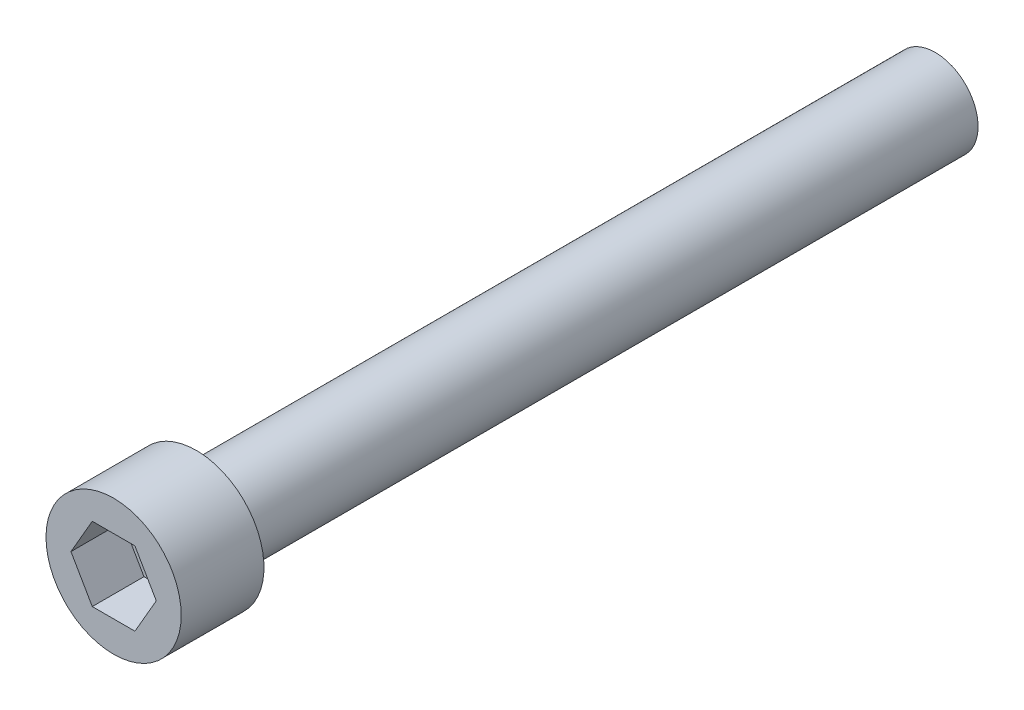
ISO-10303-21;
HEADER;
FILE_DESCRIPTION(('STEP AP214'),'2;1');
FILE_NAME('part.step','',(''),(''),'','','');
FILE_SCHEMA(('AUTOMOTIVE_DESIGN { 1 0 10303 214 1 1 1 1 }'));
ENDSEC;
DATA;
#1=APPLICATION_CONTEXT('core data for automotive mechanical design processes');
#2=APPLICATION_PROTOCOL_DEFINITION('international standard','automotive_design',2000,#1);
#3=PRODUCT_CONTEXT('',#1,'mechanical');
#4=PRODUCT('Part','Part','',(#3));
#5=PRODUCT_RELATED_PRODUCT_CATEGORY('part','',(#4));
#6=PRODUCT_DEFINITION_FORMATION('','',#4);
#7=PRODUCT_DEFINITION_CONTEXT('part definition',#1,'design');
#8=PRODUCT_DEFINITION('design','',#6,#7);
#9=PRODUCT_DEFINITION_SHAPE('','',#8);
#10=(LENGTH_UNIT() NAMED_UNIT(*) SI_UNIT(.MILLI.,.METRE.));
#11=(NAMED_UNIT(*) PLANE_ANGLE_UNIT() SI_UNIT($,.RADIAN.));
#12=(NAMED_UNIT(*) SI_UNIT($,.STERADIAN.) SOLID_ANGLE_UNIT());
#13=UNCERTAINTY_MEASURE_WITH_UNIT(LENGTH_MEASURE(1.E-05),#10,'distance_accuracy_value','');
#14=(GEOMETRIC_REPRESENTATION_CONTEXT(3) GLOBAL_UNCERTAINTY_ASSIGNED_CONTEXT((#13)) GLOBAL_UNIT_ASSIGNED_CONTEXT((#10,
#11,#12)) REPRESENTATION_CONTEXT('',''));
#15=CARTESIAN_POINT('',(0.,0.,0.));
#16=DIRECTION('',(0.,0.,1.));
#17=DIRECTION('',(1.,0.,0.));
#18=AXIS2_PLACEMENT_3D('',#15,#16,#17);
#19=CARTESIAN_POINT('',(0.,0.,28.2448));
#20=DIRECTION('',(0.,0.,-1.));
#21=DIRECTION('',(-1.,0.,0.));
#22=AXIS2_PLACEMENT_3D('',#19,#20,#21);
#23=CYLINDRICAL_SURFACE('',#22,2.3241);
#24=CARTESIAN_POINT('',(0.,0.,28.2448));
#25=DIRECTION('',(0.,0.,1.));
#26=DIRECTION('',(1.,0.,0.));
#27=AXIS2_PLACEMENT_3D('',#24,#25,#26);
#28=CIRCLE('',#27,2.3241);
#29=CARTESIAN_POINT('',(2.3241,0.,28.2448));
#30=VERTEX_POINT('',#29);
#31=EDGE_CURVE('E12',#30,#30,#28,.T.);
#32=ORIENTED_EDGE('',*,*,#31,.F.);
#33=EDGE_LOOP('',(#32));
#34=FACE_BOUND('',#33,.T.);
#35=CARTESIAN_POINT('',(0.,0.,25.4));
#36=DIRECTION('',(0.,0.,-1.));
#37=DIRECTION('',(-1.,0.,0.));
#38=AXIS2_PLACEMENT_3D('',#35,#36,#37);
#39=CIRCLE('',#38,2.3241);
#40=CARTESIAN_POINT('',(-2.3241,0.,25.4));
#41=VERTEX_POINT('',#40);
#42=EDGE_CURVE('E44',#41,#41,#39,.T.);
#43=ORIENTED_EDGE('',*,*,#42,.F.);
#44=EDGE_LOOP('',(#43));
#45=FACE_BOUND('',#44,.T.);
#46=ADVANCED_FACE('F41',(#34,#45),#23,.T.);
#47=CARTESIAN_POINT('',(0.,0.,28.2448));
#48=DIRECTION('',(0.,0.,1.));
#49=DIRECTION('',(1.,0.,0.));
#50=AXIS2_PLACEMENT_3D('',#47,#48,#49);
#51=PLANE('',#50);
#52=DIRECTION('',(0.5,0.866025403784439,0.));
#53=VECTOR('',#52,1.);
#54=CARTESIAN_POINT('',(0.733234841870825,-1.27,28.2448));
#55=LINE('',#54,#53);
#56=CARTESIAN_POINT('',(0.733234841870825,-1.27,28.2448));
#57=VERTEX_POINT('',#56);
#58=CARTESIAN_POINT('',(1.46646968374165,0.,28.2448));
#59=VERTEX_POINT('',#58);
#60=EDGE_CURVE('E59',#57,#59,#55,.T.);
#61=ORIENTED_EDGE('',*,*,#60,.F.);
#62=DIRECTION('',(1.,0.,0.));
#63=VECTOR('',#62,1.);
#64=CARTESIAN_POINT('',(-0.733234841870825,-1.27,28.2448));
#65=LINE('',#64,#63);
#66=CARTESIAN_POINT('',(-0.733234841870825,-1.27,28.2448));
#67=VERTEX_POINT('',#66);
#68=EDGE_CURVE('E162',#67,#57,#65,.T.);
#69=ORIENTED_EDGE('',*,*,#68,.F.);
#70=DIRECTION('',(0.5,-0.866025403784439,0.));
#71=VECTOR('',#70,1.);
#72=CARTESIAN_POINT('',(-1.46646968374165,0.,28.2448));
#73=LINE('',#72,#71);
#74=CARTESIAN_POINT('',(-1.46646968374165,0.,28.2448));
#75=VERTEX_POINT('',#74);
#76=EDGE_CURVE('E159',#75,#67,#73,.T.);
#77=ORIENTED_EDGE('',*,*,#76,.F.);
#78=DIRECTION('',(-0.5,-0.866025403784439,0.));
#79=VECTOR('',#78,1.);
#80=CARTESIAN_POINT('',(-0.733234841870826,1.27,28.2448));
#81=LINE('',#80,#79);
#82=CARTESIAN_POINT('',(-0.733234841870826,1.27,28.2448));
#83=VERTEX_POINT('',#82);
#84=EDGE_CURVE('E116',#83,#75,#81,.T.);
#85=ORIENTED_EDGE('',*,*,#84,.F.);
#86=DIRECTION('',(-1.,0.,0.));
#87=VECTOR('',#86,1.);
#88=CARTESIAN_POINT('',(0.733234841870825,1.27,28.2448));
#89=LINE('',#88,#87);
#90=CARTESIAN_POINT('',(0.733234841870825,1.27,28.2448));
#91=VERTEX_POINT('',#90);
#92=EDGE_CURVE('E153',#91,#83,#89,.T.);
#93=ORIENTED_EDGE('',*,*,#92,.F.);
#94=DIRECTION('',(-0.5,0.866025403784439,0.));
#95=VECTOR('',#94,1.);
#96=CARTESIAN_POINT('',(1.46646968374165,0.,28.2448));
#97=LINE('',#96,#95);
#98=EDGE_CURVE('E149',#59,#91,#97,.T.);
#99=ORIENTED_EDGE('',*,*,#98,.F.);
#100=EDGE_LOOP('',(#61,#69,#77,#85,#93,#99));
#101=FACE_BOUND('',#100,.T.);
#102=ORIENTED_EDGE('',*,*,#31,.T.);
#103=EDGE_LOOP('',(#102));
#104=FACE_BOUND('',#103,.T.);
#105=ADVANCED_FACE('F198',(#101,#104),#51,.T.);
#106=CARTESIAN_POINT('',(0.,0.,25.4));
#107=DIRECTION('',(0.,0.,-1.));
#108=DIRECTION('',(-1.,0.,0.));
#109=AXIS2_PLACEMENT_3D('',#106,#107,#108);
#110=PLANE('',#109);
#111=CARTESIAN_POINT('',(0.,0.,25.4));
#112=DIRECTION('',(0.,0.,-1.));
#113=DIRECTION('',(-1.,0.,0.));
#114=AXIS2_PLACEMENT_3D('',#111,#112,#113);
#115=CIRCLE('',#114,1.4732);
#116=CARTESIAN_POINT('',(-1.4732,0.,25.4));
#117=VERTEX_POINT('',#116);
#118=EDGE_CURVE('E177',#117,#117,#115,.T.);
#119=ORIENTED_EDGE('',*,*,#118,.F.);
#120=EDGE_LOOP('',(#119));
#121=FACE_BOUND('',#120,.T.);
#122=ORIENTED_EDGE('',*,*,#42,.T.);
#123=EDGE_LOOP('',(#122));
#124=FACE_BOUND('',#123,.T.);
#125=ADVANCED_FACE('F190',(#121,#124),#110,.T.);
#126=CARTESIAN_POINT('',(0.,0.,25.4));
#127=DIRECTION('',(0.,0.,-1.));
#128=DIRECTION('',(-1.,0.,0.));
#129=AXIS2_PLACEMENT_3D('',#126,#127,#128);
#130=CYLINDRICAL_SURFACE('',#129,1.4732);
#131=ORIENTED_EDGE('',*,*,#118,.T.);
#132=EDGE_LOOP('',(#131));
#133=FACE_BOUND('',#132,.T.);
#134=CARTESIAN_POINT('',(0.,0.,0.));
#135=DIRECTION('',(0.,0.,-1.));
#136=DIRECTION('',(-1.,0.,0.));
#137=AXIS2_PLACEMENT_3D('',#134,#135,#136);
#138=CIRCLE('',#137,1.4732);
#139=CARTESIAN_POINT('',(-1.4732,0.,0.));
#140=VERTEX_POINT('',#139);
#141=EDGE_CURVE('E167',#140,#140,#138,.T.);
#142=ORIENTED_EDGE('',*,*,#141,.F.);
#143=EDGE_LOOP('',(#142));
#144=FACE_BOUND('',#143,.T.);
#145=ADVANCED_FACE('F188',(#133,#144),#130,.T.);
#146=CARTESIAN_POINT('',(0.,0.,0.));
#147=DIRECTION('',(0.,0.,1.));
#148=DIRECTION('',(1.,0.,0.));
#149=AXIS2_PLACEMENT_3D('',#146,#147,#148);
#150=PLANE('',#149);
#151=ORIENTED_EDGE('',*,*,#141,.T.);
#152=EDGE_LOOP('',(#151));
#153=FACE_BOUND('',#152,.T.);
#154=ADVANCED_FACE('F186',(#153),#150,.F.);
#155=CARTESIAN_POINT('',(0.733234841870825,-1.27,26.4668));
#156=DIRECTION('',(0.866025403784439,-0.5,0.));
#157=DIRECTION('',(0.5,0.866025403784439,0.));
#158=AXIS2_PLACEMENT_3D('',#155,#156,#157);
#159=PLANE('',#158);
#160=ORIENTED_EDGE('',*,*,#60,.T.);
#161=DIRECTION('',(0.,0.,1.));
#162=VECTOR('',#161,1.);
#163=CARTESIAN_POINT('',(1.46646968374165,0.,26.4668));
#164=LINE('',#163,#162);
#165=CARTESIAN_POINT('',(1.46646968374165,0.,26.4668));
#166=VERTEX_POINT('',#165);
#167=EDGE_CURVE('E97',#166,#59,#164,.T.);
#168=ORIENTED_EDGE('',*,*,#167,.F.);
#169=DIRECTION('',(0.5,0.866025403784439,0.));
#170=VECTOR('',#169,1.);
#171=CARTESIAN_POINT('',(0.733234841870825,-1.27,26.4668));
#172=LINE('',#171,#170);
#173=CARTESIAN_POINT('',(0.733234841870825,-1.27,26.4668));
#174=VERTEX_POINT('',#173);
#175=EDGE_CURVE('E165',#174,#166,#172,.T.);
#176=ORIENTED_EDGE('',*,*,#175,.F.);
#177=DIRECTION('',(0.,0.,1.));
#178=VECTOR('',#177,1.);
#179=CARTESIAN_POINT('',(0.733234841870825,-1.27,26.4668));
#180=LINE('',#179,#178);
#181=EDGE_CURVE('E68',#174,#57,#180,.T.);
#182=ORIENTED_EDGE('',*,*,#181,.T.);
#183=EDGE_LOOP('',(#160,#168,#176,#182));
#184=FACE_BOUND('',#183,.T.);
#185=ADVANCED_FACE('F197',(#184),#159,.F.);
#186=CARTESIAN_POINT('',(-0.733234841870825,-1.27,26.4668));
#187=DIRECTION('',(0.,-1.,0.));
#188=DIRECTION('',(0.,0.,-1.));
#189=AXIS2_PLACEMENT_3D('',#186,#187,#188);
#190=PLANE('',#189);
#191=ORIENTED_EDGE('',*,*,#68,.T.);
#192=ORIENTED_EDGE('',*,*,#181,.F.);
#193=DIRECTION('',(1.,0.,0.));
#194=VECTOR('',#193,1.);
#195=CARTESIAN_POINT('',(-0.733234841870825,-1.27,26.4668));
#196=LINE('',#195,#194);
#197=CARTESIAN_POINT('',(-0.733234841870825,-1.27,26.4668));
#198=VERTEX_POINT('',#197);
#199=EDGE_CURVE('E130',#198,#174,#196,.T.);
#200=ORIENTED_EDGE('',*,*,#199,.F.);
#201=DIRECTION('',(0.,0.,1.));
#202=VECTOR('',#201,1.);
#203=CARTESIAN_POINT('',(-0.733234841870825,-1.27,26.4668));
#204=LINE('',#203,#202);
#205=EDGE_CURVE('E121',#198,#67,#204,.T.);
#206=ORIENTED_EDGE('',*,*,#205,.T.);
#207=EDGE_LOOP('',(#191,#192,#200,#206));
#208=FACE_BOUND('',#207,.T.);
#209=ADVANCED_FACE('F226',(#208),#190,.F.);
#210=CARTESIAN_POINT('',(-1.46646968374165,0.,26.4668));
#211=DIRECTION('',(-0.866025403784439,-0.5,0.));
#212=DIRECTION('',(0.5,-0.866025403784439,0.));
#213=AXIS2_PLACEMENT_3D('',#210,#211,#212);
#214=PLANE('',#213);
#215=ORIENTED_EDGE('',*,*,#76,.T.);
#216=ORIENTED_EDGE('',*,*,#205,.F.);
#217=DIRECTION('',(0.5,-0.866025403784439,0.));
#218=VECTOR('',#217,1.);
#219=CARTESIAN_POINT('',(-1.46646968374165,0.,26.4668));
#220=LINE('',#219,#218);
#221=CARTESIAN_POINT('',(-1.46646968374165,0.,26.4668));
#222=VERTEX_POINT('',#221);
#223=EDGE_CURVE('E125',#222,#198,#220,.T.);
#224=ORIENTED_EDGE('',*,*,#223,.F.);
#225=DIRECTION('',(0.,0.,1.));
#226=VECTOR('',#225,1.);
#227=CARTESIAN_POINT('',(-1.46646968374165,0.,26.4668));
#228=LINE('',#227,#226);
#229=EDGE_CURVE('E109',#222,#75,#228,.T.);
#230=ORIENTED_EDGE('',*,*,#229,.T.);
#231=EDGE_LOOP('',(#215,#216,#224,#230));
#232=FACE_BOUND('',#231,.T.);
#233=ADVANCED_FACE('F126',(#232),#214,.F.);
#234=CARTESIAN_POINT('',(-0.733234841870826,1.27,26.4668));
#235=DIRECTION('',(-0.866025403784439,0.5,0.));
#236=DIRECTION('',(-0.5,-0.866025403784439,0.));
#237=AXIS2_PLACEMENT_3D('',#234,#235,#236);
#238=PLANE('',#237);
#239=ORIENTED_EDGE('',*,*,#84,.T.);
#240=ORIENTED_EDGE('',*,*,#229,.F.);
#241=DIRECTION('',(-0.5,-0.866025403784439,0.));
#242=VECTOR('',#241,1.);
#243=CARTESIAN_POINT('',(-0.733234841870826,1.27,26.4668));
#244=LINE('',#243,#242);
#245=CARTESIAN_POINT('',(-0.733234841870826,1.27,26.4668));
#246=VERTEX_POINT('',#245);
#247=EDGE_CURVE('E113',#246,#222,#244,.T.);
#248=ORIENTED_EDGE('',*,*,#247,.F.);
#249=DIRECTION('',(0.,0.,1.));
#250=VECTOR('',#249,1.);
#251=CARTESIAN_POINT('',(-0.733234841870826,1.27,26.4668));
#252=LINE('',#251,#250);
#253=EDGE_CURVE('E122',#246,#83,#252,.T.);
#254=ORIENTED_EDGE('',*,*,#253,.T.);
#255=EDGE_LOOP('',(#239,#240,#248,#254));
#256=FACE_BOUND('',#255,.T.);
#257=ADVANCED_FACE('F111',(#256),#238,.F.);
#258=CARTESIAN_POINT('',(0.733234841870825,1.27,26.4668));
#259=DIRECTION('',(0.,1.,0.));
#260=DIRECTION('',(-1.,0.,0.));
#261=AXIS2_PLACEMENT_3D('',#258,#259,#260);
#262=PLANE('',#261);
#263=ORIENTED_EDGE('',*,*,#92,.T.);
#264=ORIENTED_EDGE('',*,*,#253,.F.);
#265=DIRECTION('',(-1.,0.,0.));
#266=VECTOR('',#265,1.);
#267=CARTESIAN_POINT('',(0.733234841870825,1.27,26.4668));
#268=LINE('',#267,#266);
#269=CARTESIAN_POINT('',(0.733234841870825,1.27,26.4668));
#270=VERTEX_POINT('',#269);
#271=EDGE_CURVE('E136',#270,#246,#268,.T.);
#272=ORIENTED_EDGE('',*,*,#271,.F.);
#273=DIRECTION('',(0.,0.,1.));
#274=VECTOR('',#273,1.);
#275=CARTESIAN_POINT('',(0.733234841870825,1.27,26.4668));
#276=LINE('',#275,#274);
#277=EDGE_CURVE('E172',#270,#91,#276,.T.);
#278=ORIENTED_EDGE('',*,*,#277,.T.);
#279=EDGE_LOOP('',(#263,#264,#272,#278));
#280=FACE_BOUND('',#279,.T.);
#281=ADVANCED_FACE('F234',(#280),#262,.F.);
#282=CARTESIAN_POINT('',(1.46646968374165,0.,26.4668));
#283=DIRECTION('',(0.866025403784439,0.5,0.));
#284=DIRECTION('',(-0.5,0.866025403784439,0.));
#285=AXIS2_PLACEMENT_3D('',#282,#283,#284);
#286=PLANE('',#285);
#287=ORIENTED_EDGE('',*,*,#98,.T.);
#288=ORIENTED_EDGE('',*,*,#277,.F.);
#289=DIRECTION('',(-0.5,0.866025403784439,0.));
#290=VECTOR('',#289,1.);
#291=CARTESIAN_POINT('',(1.46646968374165,0.,26.4668));
#292=LINE('',#291,#290);
#293=EDGE_CURVE('E141',#166,#270,#292,.T.);
#294=ORIENTED_EDGE('',*,*,#293,.F.);
#295=ORIENTED_EDGE('',*,*,#167,.T.);
#296=EDGE_LOOP('',(#287,#288,#294,#295));
#297=FACE_BOUND('',#296,.T.);
#298=ADVANCED_FACE('F221',(#297),#286,.F.);
#299=CARTESIAN_POINT('',(1.46646968374165,0.,26.4668));
#300=DIRECTION('',(0.,0.,1.));
#301=DIRECTION('',(1.,0.,0.));
#302=AXIS2_PLACEMENT_3D('',#299,#300,#301);
#303=PLANE('',#302);
#304=ORIENTED_EDGE('',*,*,#175,.T.);
#305=ORIENTED_EDGE('',*,*,#293,.T.);
#306=ORIENTED_EDGE('',*,*,#271,.T.);
#307=ORIENTED_EDGE('',*,*,#247,.T.);
#308=ORIENTED_EDGE('',*,*,#223,.T.);
#309=ORIENTED_EDGE('',*,*,#199,.T.);
#310=EDGE_LOOP('',(#304,#305,#306,#307,#308,#309));
#311=FACE_BOUND('',#310,.T.);
#312=ADVANCED_FACE('F133',(#311),#303,.T.);
#313=CLOSED_SHELL('',(#46,#105,#125,#145,#154,#185,#209,#233,#257,#281,#298,#312));
#314=MANIFOLD_SOLID_BREP('B2',#313);
#315=ADVANCED_BREP_SHAPE_REPRESENTATION('',(#18,#314),#14);
#316=SHAPE_DEFINITION_REPRESENTATION(#9,#315);
ENDSEC;
END-ISO-10303-21;
